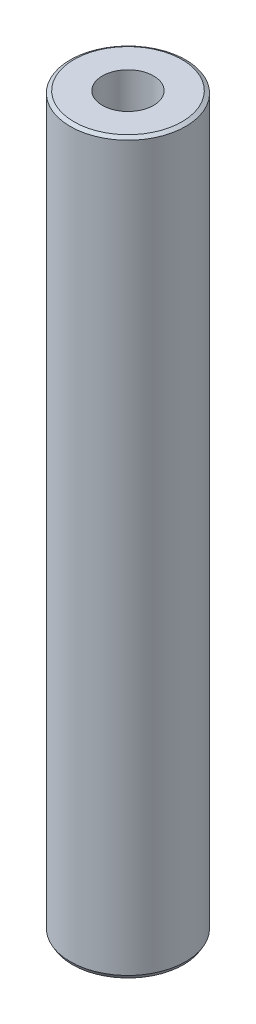
ISO-10303-21;
HEADER;
FILE_DESCRIPTION(('STEP AP214'),'2;1');
FILE_NAME('part.step','',(''),(''),'','','');
FILE_SCHEMA(('AUTOMOTIVE_DESIGN { 1 0 10303 214 1 1 1 1 }'));
ENDSEC;
DATA;
#1=APPLICATION_CONTEXT('core data for automotive mechanical design processes');
#2=APPLICATION_PROTOCOL_DEFINITION('international standard','automotive_design',2000,#1);
#3=PRODUCT_CONTEXT('',#1,'mechanical');
#4=PRODUCT('Part','Part','',(#3));
#5=PRODUCT_RELATED_PRODUCT_CATEGORY('part','',(#4));
#6=PRODUCT_DEFINITION_FORMATION('','',#4);
#7=PRODUCT_DEFINITION_CONTEXT('part definition',#1,'design');
#8=PRODUCT_DEFINITION('design','',#6,#7);
#9=PRODUCT_DEFINITION_SHAPE('','',#8);
#10=(LENGTH_UNIT() NAMED_UNIT(*) SI_UNIT(.MILLI.,.METRE.));
#11=(NAMED_UNIT(*) PLANE_ANGLE_UNIT() SI_UNIT($,.RADIAN.));
#12=(NAMED_UNIT(*) SI_UNIT($,.STERADIAN.) SOLID_ANGLE_UNIT());
#13=UNCERTAINTY_MEASURE_WITH_UNIT(LENGTH_MEASURE(1.E-05),#10,'distance_accuracy_value','');
#14=(GEOMETRIC_REPRESENTATION_CONTEXT(3) GLOBAL_UNCERTAINTY_ASSIGNED_CONTEXT((#13)) GLOBAL_UNIT_ASSIGNED_CONTEXT((#10,
#11,#12)) REPRESENTATION_CONTEXT('',''));
#15=CARTESIAN_POINT('',(0.,0.,0.));
#16=DIRECTION('',(0.,0.,1.));
#17=DIRECTION('',(1.,0.,0.));
#18=AXIS2_PLACEMENT_3D('',#15,#16,#17);
#19=CARTESIAN_POINT('',(0.,600.,0.));
#20=DIRECTION('',(0.,-1.,0.));
#21=DIRECTION('',(0.,0.,-1.));
#22=AXIS2_PLACEMENT_3D('',#19,#20,#21);
#23=CYLINDRICAL_SURFACE('',#22,47.5);
#24=CARTESIAN_POINT('',(0.,598.224595493107,0.));
#25=DIRECTION('',(0.,1.,0.));
#26=DIRECTION('',(0.,0.,1.));
#27=AXIS2_PLACEMENT_3D('',#24,#25,#26);
#28=CIRCLE('',#27,47.5);
#29=CARTESIAN_POINT('',(0.,598.224595493107,47.5));
#30=VERTEX_POINT('',#29);
#31=EDGE_CURVE('E50',#30,#30,#28,.F.);
#32=ORIENTED_EDGE('',*,*,#31,.T.);
#33=EDGE_LOOP('',(#32));
#34=FACE_BOUND('',#33,.T.);
#35=CARTESIAN_POINT('',(0.,3.07509080992607,0.));
#36=DIRECTION('',(0.,1.,0.));
#37=DIRECTION('',(0.,0.,1.));
#38=AXIS2_PLACEMENT_3D('',#35,#36,#37);
#39=CIRCLE('',#38,47.5);
#40=CARTESIAN_POINT('',(0.,3.07509080992607,47.5));
#41=VERTEX_POINT('',#40);
#42=EDGE_CURVE('E51',#41,#41,#39,.T.);
#43=ORIENTED_EDGE('',*,*,#42,.T.);
#44=EDGE_LOOP('',(#43));
#45=FACE_BOUND('',#44,.T.);
#46=ADVANCED_FACE('F39',(#34,#45),#23,.T.);
#47=CARTESIAN_POINT('',(0.,600.,0.));
#48=DIRECTION('',(0.,1.,0.));
#49=DIRECTION('',(0.,0.,1.));
#50=AXIS2_PLACEMENT_3D('',#47,#48,#49);
#51=PLANE('',#50);
#52=CARTESIAN_POINT('',(0.,600.,0.));
#53=DIRECTION('',(0.,1.,0.));
#54=DIRECTION('',(0.,0.,1.));
#55=AXIS2_PLACEMENT_3D('',#52,#53,#54);
#56=CIRCLE('',#55,44.4249091900742);
#57=CARTESIAN_POINT('',(0.,600.,44.4249091900742));
#58=VERTEX_POINT('',#57);
#59=EDGE_CURVE('E54',#58,#58,#56,.T.);
#60=ORIENTED_EDGE('',*,*,#59,.T.);
#61=EDGE_LOOP('',(#60));
#62=FACE_BOUND('',#61,.T.);
#63=CARTESIAN_POINT('',(0.,600.,0.));
#64=DIRECTION('',(0.,1.,0.));
#65=DIRECTION('',(0.,0.,1.));
#66=AXIS2_PLACEMENT_3D('',#63,#64,#65);
#67=CIRCLE('',#66,21.0519233105447);
#68=CARTESIAN_POINT('',(0.,600.,21.0519233105447));
#69=VERTEX_POINT('',#68);
#70=EDGE_CURVE('E58',#69,#69,#67,.T.);
#71=ORIENTED_EDGE('',*,*,#70,.F.);
#72=EDGE_LOOP('',(#71));
#73=FACE_BOUND('',#72,.T.);
#74=ADVANCED_FACE('F69',(#62,#73),#51,.T.);
#75=CARTESIAN_POINT('',(0.,0.,0.));
#76=DIRECTION('',(0.,1.,0.));
#77=DIRECTION('',(0.,0.,1.));
#78=AXIS2_PLACEMENT_3D('',#75,#76,#77);
#79=PLANE('',#78);
#80=CARTESIAN_POINT('',(0.,0.,0.));
#81=DIRECTION('',(0.,1.,0.));
#82=DIRECTION('',(0.,0.,1.));
#83=AXIS2_PLACEMENT_3D('',#80,#81,#82);
#84=CIRCLE('',#83,45.7245954931066);
#85=CARTESIAN_POINT('',(0.,0.,45.7245954931066));
#86=VERTEX_POINT('',#85);
#87=EDGE_CURVE('E10',#86,#86,#84,.F.);
#88=ORIENTED_EDGE('',*,*,#87,.T.);
#89=EDGE_LOOP('',(#88));
#90=FACE_BOUND('',#89,.T.);
#91=CARTESIAN_POINT('',(0.,0.,0.));
#92=DIRECTION('',(0.,1.,0.));
#93=DIRECTION('',(0.,0.,1.));
#94=AXIS2_PLACEMENT_3D('',#91,#92,#93);
#95=CIRCLE('',#94,21.0519233105447);
#96=CARTESIAN_POINT('',(0.,0.,21.0519233105447));
#97=VERTEX_POINT('',#96);
#98=EDGE_CURVE('E63',#97,#97,#95,.T.);
#99=ORIENTED_EDGE('',*,*,#98,.T.);
#100=EDGE_LOOP('',(#99));
#101=FACE_BOUND('',#100,.T.);
#102=ADVANCED_FACE('F75',(#90,#101),#79,.F.);
#103=CARTESIAN_POINT('',(0.,600.,0.));
#104=DIRECTION('',(0.,-1.,0.));
#105=DIRECTION('',(0.,0.,-1.));
#106=AXIS2_PLACEMENT_3D('',#103,#104,#105);
#107=CYLINDRICAL_SURFACE('',#106,21.0519233105447);
#108=ORIENTED_EDGE('',*,*,#70,.T.);
#109=EDGE_LOOP('',(#108));
#110=FACE_BOUND('',#109,.T.);
#111=ORIENTED_EDGE('',*,*,#98,.F.);
#112=EDGE_LOOP('',(#111));
#113=FACE_BOUND('',#112,.T.);
#114=ADVANCED_FACE('F70',(#110,#113),#107,.F.);
#115=CARTESIAN_POINT('',(0.,600.,0.));
#116=DIRECTION('',(0.,-1.,0.));
#117=DIRECTION('',(0.,0.,-1.));
#118=AXIS2_PLACEMENT_3D('',#115,#116,#117);
#119=CONICAL_SURFACE('',#118,44.4249091900742,1.0471975511966);
#120=ORIENTED_EDGE('',*,*,#31,.F.);
#121=EDGE_LOOP('',(#120));
#122=FACE_BOUND('',#121,.T.);
#123=ORIENTED_EDGE('',*,*,#59,.F.);
#124=EDGE_LOOP('',(#123));
#125=FACE_BOUND('',#124,.T.);
#126=ADVANCED_FACE('F81',(#122,#125),#119,.T.);
#127=CARTESIAN_POINT('',(0.,3.07509080992607,0.));
#128=DIRECTION('',(0.,1.,0.));
#129=DIRECTION('',(0.,0.,1.));
#130=AXIS2_PLACEMENT_3D('',#127,#128,#129);
#131=CONICAL_SURFACE('',#130,47.5,0.523598775598312);
#132=CARTESIAN_POINT('',(0.,0.,45.7245954931066));
#133=CARTESIAN_POINT('',(0.,0.0320321959367295,45.7430892900534));
#134=CARTESIAN_POINT('',(0.,0.0640643918734594,45.7615830870002));
#135=CARTESIAN_POINT('',(0.,0.128128783746919,45.7985706808938));
#136=CARTESIAN_POINT('',(0.,0.160160979683649,45.8170644778406));
#137=CARTESIAN_POINT('',(0.,0.224225371557109,45.8540520717342));
#138=CARTESIAN_POINT('',(0.,0.256257567493839,45.872545868681));
#139=CARTESIAN_POINT('',(0.,0.320321959367299,45.9095334625747));
#140=CARTESIAN_POINT('',(0.,0.352354155304029,45.9280272595215));
#141=CARTESIAN_POINT('',(0.,0.416418547177489,45.9650148534151));
#142=CARTESIAN_POINT('',(0.,0.448450743114218,45.9835086503619));
#143=CARTESIAN_POINT('',(0.,0.512515134987679,46.0204962442555));
#144=CARTESIAN_POINT('',(0.,0.544547330924409,46.0389900412023));
#145=CARTESIAN_POINT('',(0.,0.608611722797869,46.0759776350959));
#146=CARTESIAN_POINT('',(0.,0.640643918734598,46.0944714320427));
#147=CARTESIAN_POINT('',(0.,0.704708310608057,46.1314590259363));
#148=CARTESIAN_POINT('',(0.,0.736740506544788,46.1499528228831));
#149=CARTESIAN_POINT('',(0.,0.800804898418248,46.1869404167768));
#150=CARTESIAN_POINT('',(0.,0.832837094354978,46.2054342137236));
#151=CARTESIAN_POINT('',(0.,0.896901486228438,46.2424218076172));
#152=CARTESIAN_POINT('',(0.,0.928933682165167,46.260915604564));
#153=CARTESIAN_POINT('',(0.,0.992998074038627,46.2979031984576));
#154=CARTESIAN_POINT('',(0.,1.02503026997536,46.3163969954044));
#155=CARTESIAN_POINT('',(0.,1.08909466184882,46.353384589298));
#156=CARTESIAN_POINT('',(0.,1.12112685778555,46.3718783862448));
#157=CARTESIAN_POINT('',(0.,1.18519124965901,46.4088659801384));
#158=CARTESIAN_POINT('',(0.,1.21722344559574,46.4273597770852));
#159=CARTESIAN_POINT('',(0.,1.2812878374692,46.4643473709788));
#160=CARTESIAN_POINT('',(0.,1.31332003340593,46.4828411679256));
#161=CARTESIAN_POINT('',(0.,1.37738442527939,46.5198287618193));
#162=CARTESIAN_POINT('',(0.,1.40941662121612,46.5383225587661));
#163=CARTESIAN_POINT('',(0.,1.47348101308958,46.5753101526597));
#164=CARTESIAN_POINT('',(0.,1.50551320902631,46.5938039496065));
#165=CARTESIAN_POINT('',(0.,1.56957760089977,46.6307915435001));
#166=CARTESIAN_POINT('',(0.,1.6016097968365,46.6492853404469));
#167=CARTESIAN_POINT('',(0.,1.66567418870996,46.6862729343405));
#168=CARTESIAN_POINT('',(0.,1.69770638464669,46.7047667312873));
#169=CARTESIAN_POINT('',(0.,1.76177077652015,46.7417543251809));
#170=CARTESIAN_POINT('',(0.,1.79380297245688,46.7602481221277));
#171=CARTESIAN_POINT('',(0.,1.85786736433034,46.7972357160214));
#172=CARTESIAN_POINT('',(0.,1.88989956026707,46.8157295129682));
#173=CARTESIAN_POINT('',(0.,1.95396395214053,46.8527171068618));
#174=CARTESIAN_POINT('',(0.,1.98599614807726,46.8712109038086));
#175=CARTESIAN_POINT('',(0.,2.05006053995072,46.9081984977022));
#176=CARTESIAN_POINT('',(0.,2.08209273588745,46.926692294649));
#177=CARTESIAN_POINT('',(0.,2.1461571277609,46.9636798885426));
#178=CARTESIAN_POINT('',(0.,2.17818932369763,46.9821736854894));
#179=CARTESIAN_POINT('',(0.,2.24225371557109,47.019161279383));
#180=CARTESIAN_POINT('',(0.,2.27428591150782,47.0376550763298));
#181=CARTESIAN_POINT('',(0.,2.33835030338128,47.0746426702235));
#182=CARTESIAN_POINT('',(0.,2.37038249931801,47.0931364671703));
#183=CARTESIAN_POINT('',(0.,2.43444689119147,47.1301240610639));
#184=CARTESIAN_POINT('',(0.,2.4664790871282,47.1486178580107));
#185=CARTESIAN_POINT('',(0.,2.53054347900166,47.1856054519043));
#186=CARTESIAN_POINT('',(0.,2.56257567493839,47.2040992488511));
#187=CARTESIAN_POINT('',(0.,2.62664006681185,47.2410868427447));
#188=CARTESIAN_POINT('',(0.,2.65867226274858,47.2595806396915));
#189=CARTESIAN_POINT('',(0.,2.72273665462204,47.2965682335851));
#190=CARTESIAN_POINT('',(0.,2.75476885055877,47.3150620305319));
#191=CARTESIAN_POINT('',(0.,2.81883324243223,47.3520496244256));
#192=CARTESIAN_POINT('',(0.,2.85086543836896,47.3705434213724));
#193=CARTESIAN_POINT('',(0.,2.91492983024242,47.407531015266));
#194=CARTESIAN_POINT('',(0.,2.94696202617915,47.4260248122128));
#195=CARTESIAN_POINT('',(0.,3.01102641805261,47.4630124061064));
#196=CARTESIAN_POINT('',(0.,3.04305861398934,47.4815062030532));
#197=CARTESIAN_POINT('',(0.,3.07509080992607,47.5));
#198=B_SPLINE_CURVE_WITH_KNOTS('',3,(#132,#133,#134,#135,#136,#137,#138,#139,#140,#141,#142,
#143,#144,#145,#146,#147,#148,#149,#150,#151,#152,#153,#154,#155,#156,#157,#158,#159,#160,#161,
#162,#163,#164,#165,#166,#167,#168,#169,#170,#171,#172,#173,#174,#175,#176,#177,#178,#179,#180,
#181,#182,#183,#184,#185,#186,#187,#188,#189,#190,#191,#192,#193,#194,#195,#196,#197),
.UNSPECIFIED.,.F.,.F.,(4,2,2,2,2,2,2,2,2,2,2,2,2,2,2,2,2,2,2,2,2,2,2,2,2,2,2,2,2,2,2,2,4),(0.,
0.110962781680836,0.221925563361671,0.332888345042507,0.443851126723343,0.554813908404179,
0.665776690085014,0.776739471765853,0.887702253446689,0.998665035127525,1.10962781680836,
1.2205905984892,1.33155338017003,1.44251616185087,1.5534789435317,1.66444172521254,
1.77540450689338,1.88636728857421,1.99733007025505,2.10829285193589,2.21925563361672,
2.33021841529756,2.44118119697839,2.55214397865923,2.66310676034006,2.7740695420209,
2.88503232370173,2.99599510538257,3.10695788706341,3.21792066874424,3.32888345042508,
3.43984623210592,3.55080901378675),.UNSPECIFIED.);
#199=EDGE_CURVE('BSEAM45',#86,#41,#198,.T.);
#200=ORIENTED_EDGE('',*,*,#87,.F.);
#201=ORIENTED_EDGE('',*,*,#42,.F.);
#202=ORIENTED_EDGE('',*,*,#199,.T.);
#203=ORIENTED_EDGE('',*,*,#199,.F.);
#204=EDGE_LOOP('',(#200,#202,#201,#203));
#205=FACE_BOUND('',#204,.T.);
#206=ADVANCED_FACE('F45',(#205),#131,.T.);
#207=CLOSED_SHELL('',(#46,#74,#102,#114,#126,#206));
#208=MANIFOLD_SOLID_BREP('B2',#207);
#209=ADVANCED_BREP_SHAPE_REPRESENTATION('',(#18,#208),#14);
#210=SHAPE_DEFINITION_REPRESENTATION(#9,#209);
ENDSEC;
END-ISO-10303-21;
